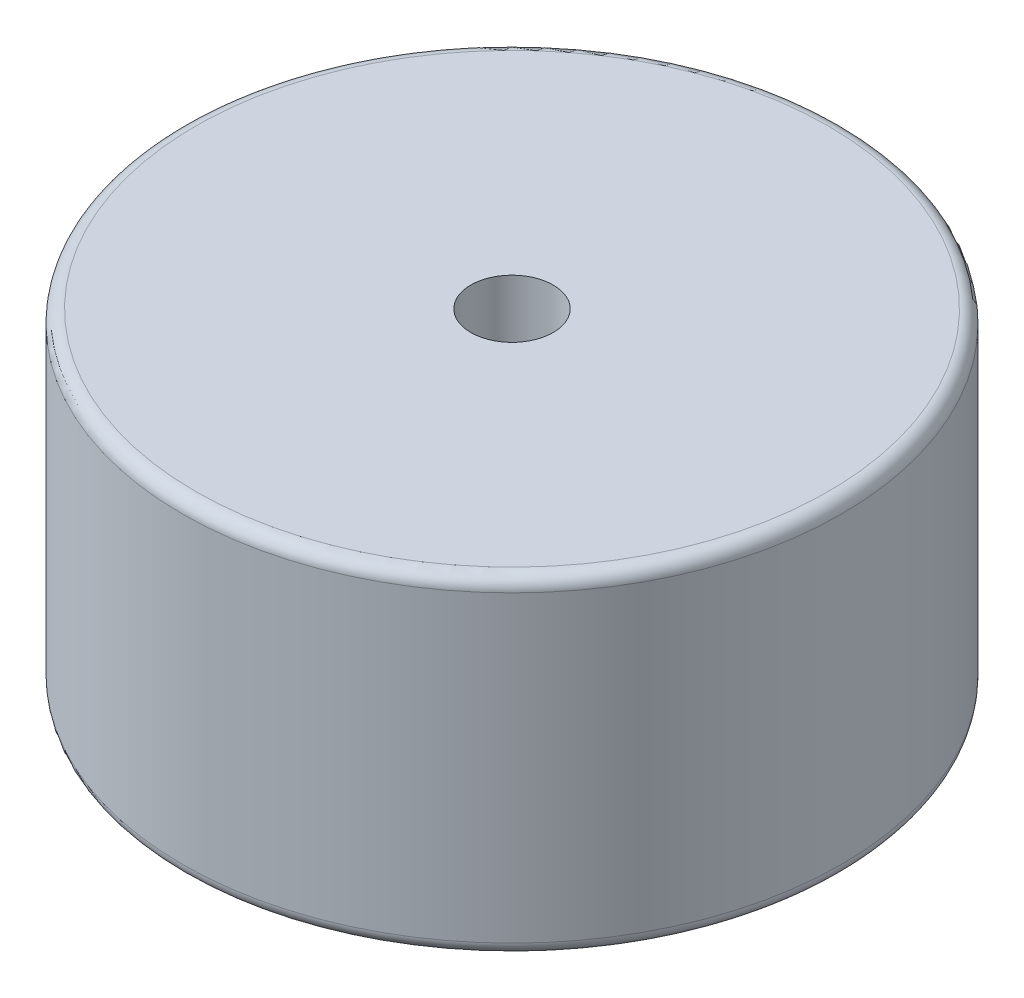
ISO-10303-21;
HEADER;
FILE_DESCRIPTION(('STEP AP214'),'2;1');
FILE_NAME('part.step','',(''),(''),'','','');
FILE_SCHEMA(('AUTOMOTIVE_DESIGN { 1 0 10303 214 1 1 1 1 }'));
ENDSEC;
DATA;
#1=APPLICATION_CONTEXT('core data for automotive mechanical design processes');
#2=APPLICATION_PROTOCOL_DEFINITION('international standard','automotive_design',2000,#1);
#3=PRODUCT_CONTEXT('',#1,'mechanical');
#4=PRODUCT('Part','Part','',(#3));
#5=PRODUCT_RELATED_PRODUCT_CATEGORY('part','',(#4));
#6=PRODUCT_DEFINITION_FORMATION('','',#4);
#7=PRODUCT_DEFINITION_CONTEXT('part definition',#1,'design');
#8=PRODUCT_DEFINITION('design','',#6,#7);
#9=PRODUCT_DEFINITION_SHAPE('','',#8);
#10=(LENGTH_UNIT() NAMED_UNIT(*) SI_UNIT(.MILLI.,.METRE.));
#11=(NAMED_UNIT(*) PLANE_ANGLE_UNIT() SI_UNIT($,.RADIAN.));
#12=(NAMED_UNIT(*) SI_UNIT($,.STERADIAN.) SOLID_ANGLE_UNIT());
#13=UNCERTAINTY_MEASURE_WITH_UNIT(LENGTH_MEASURE(1.E-05),#10,'distance_accuracy_value','');
#14=(GEOMETRIC_REPRESENTATION_CONTEXT(3) GLOBAL_UNCERTAINTY_ASSIGNED_CONTEXT((#13)) GLOBAL_UNIT_ASSIGNED_CONTEXT((#10,
#11,#12)) REPRESENTATION_CONTEXT('',''));
#15=CARTESIAN_POINT('',(0.,0.,0.));
#16=DIRECTION('',(0.,0.,1.));
#17=DIRECTION('',(1.,0.,0.));
#18=AXIS2_PLACEMENT_3D('',#15,#16,#17);
#19=CARTESIAN_POINT('',(0.,20.,0.));
#20=DIRECTION('',(0.,-1.,0.));
#21=DIRECTION('',(0.,0.,-1.));
#22=AXIS2_PLACEMENT_3D('',#19,#20,#21);
#23=CYLINDRICAL_SURFACE('',#22,20.);
#24=CARTESIAN_POINT('',(0.,0.793749999999999,0.));
#25=DIRECTION('',(0.,1.,0.));
#26=DIRECTION('',(0.,0.,1.));
#27=AXIS2_PLACEMENT_3D('',#24,#25,#26);
#28=CIRCLE('',#27,20.);
#29=CARTESIAN_POINT('',(0.,0.793749999999999,20.));
#30=VERTEX_POINT('',#29);
#31=EDGE_CURVE('E43',#30,#30,#28,.T.);
#32=ORIENTED_EDGE('',*,*,#31,.T.);
#33=EDGE_LOOP('',(#32));
#34=FACE_BOUND('',#33,.T.);
#35=CARTESIAN_POINT('',(0.,19.20625,0.));
#36=DIRECTION('',(0.,1.,0.));
#37=DIRECTION('',(0.,0.,1.));
#38=AXIS2_PLACEMENT_3D('',#35,#36,#37);
#39=CIRCLE('',#38,20.);
#40=CARTESIAN_POINT('',(0.,19.20625,20.));
#41=VERTEX_POINT('',#40);
#42=EDGE_CURVE('E47',#41,#41,#39,.F.);
#43=ORIENTED_EDGE('',*,*,#42,.T.);
#44=EDGE_LOOP('',(#43));
#45=FACE_BOUND('',#44,.T.);
#46=ADVANCED_FACE('F32',(#34,#45),#23,.T.);
#47=CARTESIAN_POINT('',(0.,20.,0.));
#48=DIRECTION('',(0.,1.,0.));
#49=DIRECTION('',(0.,0.,1.));
#50=AXIS2_PLACEMENT_3D('',#47,#48,#49);
#51=PLANE('',#50);
#52=CARTESIAN_POINT('',(0.,20.,0.));
#53=DIRECTION('',(0.,1.,0.));
#54=DIRECTION('',(0.,0.,1.));
#55=AXIS2_PLACEMENT_3D('',#52,#53,#54);
#56=CIRCLE('',#55,19.20625);
#57=CARTESIAN_POINT('',(0.,20.,19.20625));
#58=VERTEX_POINT('',#57);
#59=EDGE_CURVE('E10',#58,#58,#56,.T.);
#60=ORIENTED_EDGE('',*,*,#59,.T.);
#61=EDGE_LOOP('',(#60));
#62=FACE_BOUND('',#61,.T.);
#63=CARTESIAN_POINT('',(0.,20.,0.));
#64=DIRECTION('',(0.,1.,0.));
#65=DIRECTION('',(0.,0.,1.));
#66=AXIS2_PLACEMENT_3D('',#63,#64,#65);
#67=CIRCLE('',#66,2.5);
#68=CARTESIAN_POINT('',(0.,20.,2.5));
#69=VERTEX_POINT('',#68);
#70=EDGE_CURVE('E53',#69,#69,#67,.T.);
#71=ORIENTED_EDGE('',*,*,#70,.F.);
#72=EDGE_LOOP('',(#71));
#73=FACE_BOUND('',#72,.T.);
#74=ADVANCED_FACE('F90',(#62,#73),#51,.T.);
#75=CARTESIAN_POINT('',(0.,0.,0.));
#76=DIRECTION('',(0.,1.,0.));
#77=DIRECTION('',(0.,0.,1.));
#78=AXIS2_PLACEMENT_3D('',#75,#76,#77);
#79=PLANE('',#78);
#80=CARTESIAN_POINT('',(0.,0.,0.));
#81=DIRECTION('',(0.,-1.,0.));
#82=DIRECTION('',(0.,0.,-1.));
#83=AXIS2_PLACEMENT_3D('',#80,#81,#82);
#84=CIRCLE('',#83,17.);
#85=CARTESIAN_POINT('',(0.,0.,-17.));
#86=VERTEX_POINT('',#85);
#87=EDGE_CURVE('E59',#86,#86,#84,.T.);
#88=ORIENTED_EDGE('',*,*,#87,.F.);
#89=EDGE_LOOP('',(#88));
#90=FACE_BOUND('',#89,.T.);
#91=CARTESIAN_POINT('',(0.,0.,0.));
#92=DIRECTION('',(0.,1.,0.));
#93=DIRECTION('',(0.,0.,1.));
#94=AXIS2_PLACEMENT_3D('',#91,#92,#93);
#95=CIRCLE('',#94,19.20625);
#96=CARTESIAN_POINT('',(0.,0.,19.20625));
#97=VERTEX_POINT('',#96);
#98=EDGE_CURVE('E39',#97,#97,#95,.F.);
#99=ORIENTED_EDGE('',*,*,#98,.T.);
#100=EDGE_LOOP('',(#99));
#101=FACE_BOUND('',#100,.T.);
#102=ADVANCED_FACE('F87',(#90,#101),#79,.F.);
#103=CARTESIAN_POINT('',(0.,8.,0.));
#104=DIRECTION('',(0.,1.,0.));
#105=DIRECTION('',(0.,0.,1.));
#106=AXIS2_PLACEMENT_3D('',#103,#104,#105);
#107=CYLINDRICAL_SURFACE('',#106,2.5);
#108=CARTESIAN_POINT('',(0.,8.,0.));
#109=DIRECTION('',(0.,1.,0.));
#110=DIRECTION('',(0.,0.,1.));
#111=AXIS2_PLACEMENT_3D('',#108,#109,#110);
#112=CIRCLE('',#111,2.5);
#113=CARTESIAN_POINT('',(0.,8.,2.5));
#114=VERTEX_POINT('',#113);
#115=EDGE_CURVE('E52',#114,#114,#112,.T.);
#116=ORIENTED_EDGE('',*,*,#115,.F.);
#117=EDGE_LOOP('',(#116));
#118=FACE_BOUND('',#117,.T.);
#119=ORIENTED_EDGE('',*,*,#70,.T.);
#120=EDGE_LOOP('',(#119));
#121=FACE_BOUND('',#120,.T.);
#122=ADVANCED_FACE('F89',(#118,#121),#107,.F.);
#123=CARTESIAN_POINT('',(0.,8.,0.));
#124=DIRECTION('',(0.,1.,0.));
#125=DIRECTION('',(0.,0.,1.));
#126=AXIS2_PLACEMENT_3D('',#123,#124,#125);
#127=PLANE('',#126);
#128=ORIENTED_EDGE('',*,*,#115,.T.);
#129=EDGE_LOOP('',(#128));
#130=FACE_BOUND('',#129,.T.);
#131=ADVANCED_FACE('F96',(#130),#127,.T.);
#132=CARTESIAN_POINT('',(0.,0.793749999999999,0.));
#133=DIRECTION('',(0.,1.,0.));
#134=DIRECTION('',(0.,0.,1.));
#135=AXIS2_PLACEMENT_3D('',#132,#133,#134);
#136=TOROIDAL_SURFACE('',#135,19.20625,0.79375);
#137=ORIENTED_EDGE('',*,*,#98,.F.);
#138=EDGE_LOOP('',(#137));
#139=FACE_BOUND('',#138,.T.);
#140=ORIENTED_EDGE('',*,*,#31,.F.);
#141=EDGE_LOOP('',(#140));
#142=FACE_BOUND('',#141,.T.);
#143=ADVANCED_FACE('F108',(#139,#142),#136,.T.);
#144=CARTESIAN_POINT('',(0.,19.20625,0.));
#145=DIRECTION('',(0.,1.,0.));
#146=DIRECTION('',(0.,0.,1.));
#147=AXIS2_PLACEMENT_3D('',#144,#145,#146);
#148=TOROIDAL_SURFACE('',#147,19.20625,0.79375);
#149=ORIENTED_EDGE('',*,*,#42,.F.);
#150=EDGE_LOOP('',(#149));
#151=FACE_BOUND('',#150,.T.);
#152=ORIENTED_EDGE('',*,*,#59,.F.);
#153=EDGE_LOOP('',(#152));
#154=FACE_BOUND('',#153,.T.);
#155=ADVANCED_FACE('F34',(#151,#154),#148,.T.);
#156=CARTESIAN_POINT('',(0.,0.79375,0.));
#157=DIRECTION('',(0.,-1.,0.));
#158=DIRECTION('',(0.,0.,-1.));
#159=AXIS2_PLACEMENT_3D('',#156,#157,#158);
#160=CYLINDRICAL_SURFACE('',#159,9.);
#161=CARTESIAN_POINT('',(0.,0.79375,0.));
#162=DIRECTION('',(0.,-1.,0.));
#163=DIRECTION('',(0.,0.,-1.));
#164=AXIS2_PLACEMENT_3D('',#161,#162,#163);
#165=CIRCLE('',#164,9.);
#166=CARTESIAN_POINT('',(0.,0.79375,-9.));
#167=VERTEX_POINT('',#166);
#168=EDGE_CURVE('E62',#167,#167,#165,.T.);
#169=ORIENTED_EDGE('',*,*,#168,.T.);
#170=EDGE_LOOP('',(#169));
#171=FACE_BOUND('',#170,.T.);
#172=CARTESIAN_POINT('',(0.,0.,0.));
#173=DIRECTION('',(0.,-1.,0.));
#174=DIRECTION('',(0.,0.,-1.));
#175=AXIS2_PLACEMENT_3D('',#172,#173,#174);
#176=CIRCLE('',#175,9.);
#177=CARTESIAN_POINT('',(0.,0.,-9.));
#178=VERTEX_POINT('',#177);
#179=EDGE_CURVE('E63',#178,#178,#176,.T.);
#180=ORIENTED_EDGE('',*,*,#179,.F.);
#181=EDGE_LOOP('',(#180));
#182=FACE_BOUND('',#181,.T.);
#183=ADVANCED_FACE('F71',(#171,#182),#160,.T.);
#184=CARTESIAN_POINT('',(0.,0.79375,0.));
#185=DIRECTION('',(0.,-1.,0.));
#186=DIRECTION('',(0.,0.,-1.));
#187=AXIS2_PLACEMENT_3D('',#184,#185,#186);
#188=CYLINDRICAL_SURFACE('',#187,17.);
#189=CARTESIAN_POINT('',(0.,0.79375,0.));
#190=DIRECTION('',(0.,-1.,0.));
#191=DIRECTION('',(0.,0.,-1.));
#192=AXIS2_PLACEMENT_3D('',#189,#190,#191);
#193=CIRCLE('',#192,17.);
#194=CARTESIAN_POINT('',(0.,0.79375,-17.));
#195=VERTEX_POINT('',#194);
#196=EDGE_CURVE('E56',#195,#195,#193,.T.);
#197=ORIENTED_EDGE('',*,*,#196,.F.);
#198=EDGE_LOOP('',(#197));
#199=FACE_BOUND('',#198,.T.);
#200=ORIENTED_EDGE('',*,*,#87,.T.);
#201=EDGE_LOOP('',(#200));
#202=FACE_BOUND('',#201,.T.);
#203=ADVANCED_FACE('F78',(#199,#202),#188,.F.);
#204=CARTESIAN_POINT('',(0.,0.79375,0.));
#205=DIRECTION('',(0.,-1.,0.));
#206=DIRECTION('',(0.,0.,-1.));
#207=AXIS2_PLACEMENT_3D('',#204,#205,#206);
#208=PLANE('',#207);
#209=ORIENTED_EDGE('',*,*,#168,.F.);
#210=EDGE_LOOP('',(#209));
#211=FACE_BOUND('',#210,.T.);
#212=ORIENTED_EDGE('',*,*,#196,.T.);
#213=EDGE_LOOP('',(#212));
#214=FACE_BOUND('',#213,.T.);
#215=ADVANCED_FACE('F74',(#211,#214),#208,.T.);
#216=ORIENTED_EDGE('',*,*,#179,.T.);
#217=EDGE_LOOP('',(#216));
#218=FACE_BOUND('',#217,.T.);
#219=ADVANCED_FACE('F77',(#218),#79,.F.);
#220=CLOSED_SHELL('',(#46,#74,#102,#122,#131,#143,#155,#183,#203,#215,#219));
#221=MANIFOLD_SOLID_BREP('B2',#220);
#222=ADVANCED_BREP_SHAPE_REPRESENTATION('',(#18,#221),#14);
#223=SHAPE_DEFINITION_REPRESENTATION(#9,#222);
ENDSEC;
END-ISO-10303-21;
